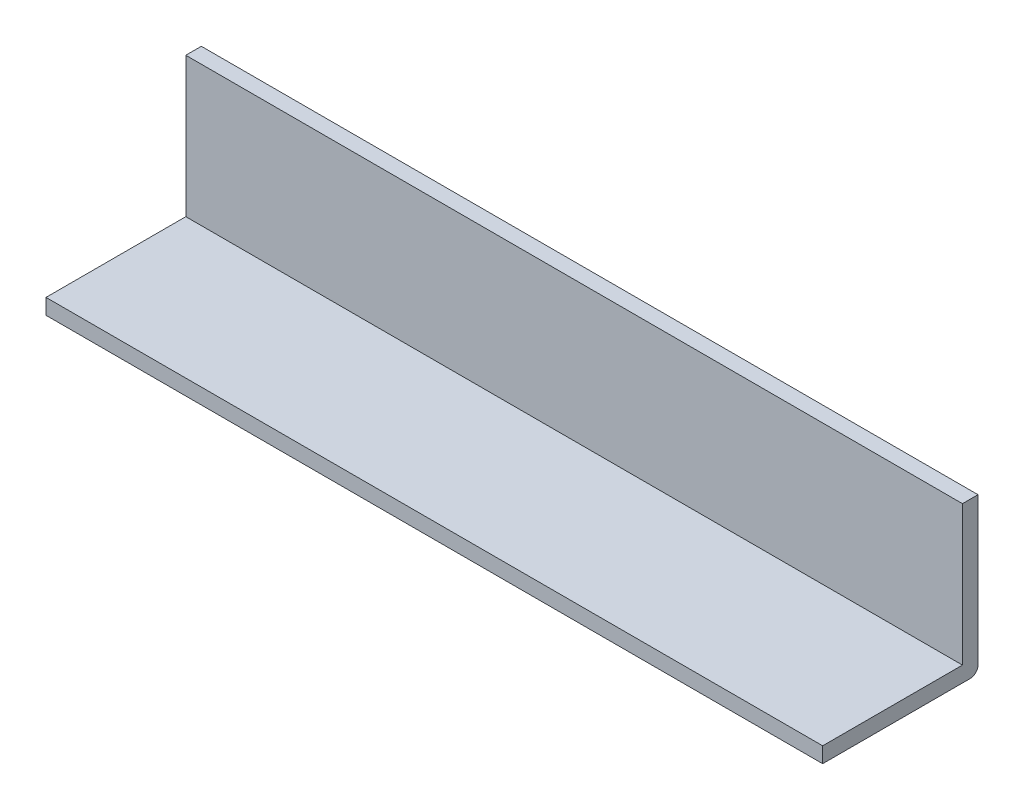
ISO-10303-21;
HEADER;
FILE_DESCRIPTION(('STEP AP214'),'2;1');
FILE_NAME('part.step','',(''),(''),'','','');
FILE_SCHEMA(('AUTOMOTIVE_DESIGN { 1 0 10303 214 1 1 1 1 }'));
ENDSEC;
DATA;
#1=APPLICATION_CONTEXT('core data for automotive mechanical design processes');
#2=APPLICATION_PROTOCOL_DEFINITION('international standard','automotive_design',2000,#1);
#3=PRODUCT_CONTEXT('',#1,'mechanical');
#4=PRODUCT('Part','Part','',(#3));
#5=PRODUCT_RELATED_PRODUCT_CATEGORY('part','',(#4));
#6=PRODUCT_DEFINITION_FORMATION('','',#4);
#7=PRODUCT_DEFINITION_CONTEXT('part definition',#1,'design');
#8=PRODUCT_DEFINITION('design','',#6,#7);
#9=PRODUCT_DEFINITION_SHAPE('','',#8);
#10=(LENGTH_UNIT() NAMED_UNIT(*) SI_UNIT(.MILLI.,.METRE.));
#11=(NAMED_UNIT(*) PLANE_ANGLE_UNIT() SI_UNIT($,.RADIAN.));
#12=(NAMED_UNIT(*) SI_UNIT($,.STERADIAN.) SOLID_ANGLE_UNIT());
#13=UNCERTAINTY_MEASURE_WITH_UNIT(LENGTH_MEASURE(1.E-05),#10,'distance_accuracy_value','');
#14=(GEOMETRIC_REPRESENTATION_CONTEXT(3) GLOBAL_UNCERTAINTY_ASSIGNED_CONTEXT((#13)) GLOBAL_UNIT_ASSIGNED_CONTEXT((#10,
#11,#12)) REPRESENTATION_CONTEXT('',''));
#15=CARTESIAN_POINT('',(0.,0.,0.));
#16=DIRECTION('',(0.,0.,1.));
#17=DIRECTION('',(1.,0.,0.));
#18=AXIS2_PLACEMENT_3D('',#15,#16,#17);
#19=CARTESIAN_POINT('',(50.,6.31112979018479,-0.871241454827603));
#20=DIRECTION('',(0.,1.,0.));
#21=DIRECTION('',(0.,0.,1.));
#22=AXIS2_PLACEMENT_3D('',#19,#20,#21);
#23=PLANE('',#22);
#24=DIRECTION('',(0.,0.,-1.));
#25=VECTOR('',#24,1.);
#26=CARTESIAN_POINT('',(0.,6.31112979018479,-0.871241454827603));
#27=LINE('',#26,#25);
#28=CARTESIAN_POINT('',(0.,6.31112979018478,19.6378948464823));
#29=VERTEX_POINT('',#28);
#30=CARTESIAN_POINT('',(0.,6.31112979018479,10.1378948464823));
#31=VERTEX_POINT('',#30);
#32=EDGE_CURVE('E121',#29,#31,#27,.T.);
#33=ORIENTED_EDGE('',*,*,#32,.T.);
#34=DIRECTION('',(-1.,0.,0.));
#35=VECTOR('',#34,1.);
#36=CARTESIAN_POINT('',(50.,6.31112979018479,10.1378948464823));
#37=LINE('',#36,#35);
#38=CARTESIAN_POINT('',(50.,6.31112979018479,10.1378948464823));
#39=VERTEX_POINT('',#38);
#40=EDGE_CURVE('E11',#39,#31,#37,.T.);
#41=ORIENTED_EDGE('',*,*,#40,.F.);
#42=DIRECTION('',(0.,0.,-1.));
#43=VECTOR('',#42,1.);
#44=CARTESIAN_POINT('',(50.,6.31112979018479,-0.871241454827603));
#45=LINE('',#44,#43);
#46=CARTESIAN_POINT('',(50.,6.31112979018478,19.6378948464823));
#47=VERTEX_POINT('',#46);
#48=EDGE_CURVE('E82',#47,#39,#45,.T.);
#49=ORIENTED_EDGE('',*,*,#48,.F.);
#50=DIRECTION('',(-1.,0.,0.));
#51=VECTOR('',#50,1.);
#52=CARTESIAN_POINT('',(50.,6.31112979018478,19.6378948464823));
#53=LINE('',#52,#51);
#54=EDGE_CURVE('E117',#47,#29,#53,.T.);
#55=ORIENTED_EDGE('',*,*,#54,.T.);
#56=EDGE_LOOP('',(#33,#41,#49,#55));
#57=FACE_BOUND('',#56,.T.);
#58=ADVANCED_FACE('F33',(#57),#23,.F.);
#59=CARTESIAN_POINT('',(50.,6.81112979018479,10.1378948464823));
#60=DIRECTION('',(-1.,0.,0.));
#61=DIRECTION('',(0.,0.,1.));
#62=AXIS2_PLACEMENT_3D('',#59,#60,#61);
#63=CYLINDRICAL_SURFACE('',#62,0.5);
#64=CARTESIAN_POINT('',(0.,6.81112979018479,10.1378948464823));
#65=DIRECTION('',(1.,0.,0.));
#66=DIRECTION('',(0.,0.,-1.));
#67=AXIS2_PLACEMENT_3D('',#64,#65,#66);
#68=CIRCLE('',#67,0.5);
#69=CARTESIAN_POINT('',(0.,6.81112979018479,9.63789484648225));
#70=VERTEX_POINT('',#69);
#71=EDGE_CURVE('E124',#70,#31,#68,.F.);
#72=ORIENTED_EDGE('',*,*,#71,.F.);
#73=DIRECTION('',(-1.,0.,0.));
#74=VECTOR('',#73,1.);
#75=CARTESIAN_POINT('',(50.,6.81112979018479,9.63789484648225));
#76=LINE('',#75,#74);
#77=CARTESIAN_POINT('',(50.,6.81112979018479,9.63789484648225));
#78=VERTEX_POINT('',#77);
#79=EDGE_CURVE('E41',#78,#70,#76,.T.);
#80=ORIENTED_EDGE('',*,*,#79,.F.);
#81=CARTESIAN_POINT('',(50.,6.81112979018479,10.1378948464823));
#82=DIRECTION('',(1.,0.,0.));
#83=DIRECTION('',(0.,0.,-1.));
#84=AXIS2_PLACEMENT_3D('',#81,#82,#83);
#85=CIRCLE('',#84,0.5);
#86=EDGE_CURVE('E156',#78,#39,#85,.F.);
#87=ORIENTED_EDGE('',*,*,#86,.T.);
#88=ORIENTED_EDGE('',*,*,#40,.T.);
#89=EDGE_LOOP('',(#72,#80,#87,#88));
#90=FACE_BOUND('',#89,.T.);
#91=ADVANCED_FACE('F149',(#90),#63,.T.);
#92=CARTESIAN_POINT('',(50.,9.09144815564303,9.63789484648225));
#93=DIRECTION('',(0.,0.,-1.));
#94=DIRECTION('',(-1.,0.,0.));
#95=AXIS2_PLACEMENT_3D('',#92,#93,#94);
#96=PLANE('',#95);
#97=DIRECTION('',(0.,-1.,0.));
#98=VECTOR('',#97,1.);
#99=CARTESIAN_POINT('',(0.,9.09144815564303,9.63789484648225));
#100=LINE('',#99,#98);
#101=CARTESIAN_POINT('',(0.,16.3111297901848,9.63789484648225));
#102=VERTEX_POINT('',#101);
#103=EDGE_CURVE('E127',#102,#70,#100,.T.);
#104=ORIENTED_EDGE('',*,*,#103,.F.);
#105=DIRECTION('',(-1.,0.,0.));
#106=VECTOR('',#105,1.);
#107=CARTESIAN_POINT('',(50.,16.3111297901848,9.63789484648225));
#108=LINE('',#107,#106);
#109=CARTESIAN_POINT('',(50.,16.3111297901848,9.63789484648225));
#110=VERTEX_POINT('',#109);
#111=EDGE_CURVE('E140',#110,#102,#108,.T.);
#112=ORIENTED_EDGE('',*,*,#111,.F.);
#113=DIRECTION('',(0.,-1.,0.));
#114=VECTOR('',#113,1.);
#115=CARTESIAN_POINT('',(50.,9.09144815564303,9.63789484648225));
#116=LINE('',#115,#114);
#117=EDGE_CURVE('E146',#110,#78,#116,.T.);
#118=ORIENTED_EDGE('',*,*,#117,.T.);
#119=ORIENTED_EDGE('',*,*,#79,.T.);
#120=EDGE_LOOP('',(#104,#112,#118,#119));
#121=FACE_BOUND('',#120,.T.);
#122=ADVANCED_FACE('F145',(#121),#96,.T.);
#123=CARTESIAN_POINT('',(50.,16.3111297901848,-0.871241454827603));
#124=DIRECTION('',(0.,-1.,0.));
#125=DIRECTION('',(0.,0.,-1.));
#126=AXIS2_PLACEMENT_3D('',#123,#124,#125);
#127=PLANE('',#126);
#128=DIRECTION('',(0.,0.,1.));
#129=VECTOR('',#128,1.);
#130=CARTESIAN_POINT('',(0.,16.3111297901848,-0.871241454827603));
#131=LINE('',#130,#129);
#132=CARTESIAN_POINT('',(0.,16.3111297901848,10.6378948464823));
#133=VERTEX_POINT('',#132);
#134=EDGE_CURVE('E130',#102,#133,#131,.T.);
#135=ORIENTED_EDGE('',*,*,#134,.T.);
#136=DIRECTION('',(-1.,0.,0.));
#137=VECTOR('',#136,1.);
#138=CARTESIAN_POINT('',(50.,16.3111297901848,10.6378948464823));
#139=LINE('',#138,#137);
#140=CARTESIAN_POINT('',(50.,16.3111297901848,10.6378948464823));
#141=VERTEX_POINT('',#140);
#142=EDGE_CURVE('E106',#141,#133,#139,.T.);
#143=ORIENTED_EDGE('',*,*,#142,.F.);
#144=DIRECTION('',(0.,0.,1.));
#145=VECTOR('',#144,1.);
#146=CARTESIAN_POINT('',(50.,16.3111297901848,-0.871241454827603));
#147=LINE('',#146,#145);
#148=EDGE_CURVE('E112',#110,#141,#147,.T.);
#149=ORIENTED_EDGE('',*,*,#148,.F.);
#150=ORIENTED_EDGE('',*,*,#111,.T.);
#151=EDGE_LOOP('',(#135,#143,#149,#150));
#152=FACE_BOUND('',#151,.T.);
#153=ADVANCED_FACE('F155',(#152),#127,.F.);
#154=CARTESIAN_POINT('',(50.,9.09144815564303,10.6378948464823));
#155=DIRECTION('',(0.,0.,1.));
#156=DIRECTION('',(1.,0.,0.));
#157=AXIS2_PLACEMENT_3D('',#154,#155,#156);
#158=PLANE('',#157);
#159=DIRECTION('',(0.,1.,0.));
#160=VECTOR('',#159,1.);
#161=CARTESIAN_POINT('',(0.,9.09144815564303,10.6378948464823));
#162=LINE('',#161,#160);
#163=CARTESIAN_POINT('',(0.,7.31112979018478,10.6378948464823));
#164=VERTEX_POINT('',#163);
#165=EDGE_CURVE('E101',#164,#133,#162,.T.);
#166=ORIENTED_EDGE('',*,*,#165,.F.);
#167=DIRECTION('',(-1.,0.,0.));
#168=VECTOR('',#167,1.);
#169=CARTESIAN_POINT('',(50.,7.31112979018478,10.6378948464823));
#170=LINE('',#169,#168);
#171=CARTESIAN_POINT('',(50.,7.31112979018478,10.6378948464823));
#172=VERTEX_POINT('',#171);
#173=EDGE_CURVE('E96',#172,#164,#170,.T.);
#174=ORIENTED_EDGE('',*,*,#173,.F.);
#175=DIRECTION('',(0.,1.,0.));
#176=VECTOR('',#175,1.);
#177=CARTESIAN_POINT('',(50.,9.09144815564303,10.6378948464823));
#178=LINE('',#177,#176);
#179=EDGE_CURVE('E99',#172,#141,#178,.T.);
#180=ORIENTED_EDGE('',*,*,#179,.T.);
#181=ORIENTED_EDGE('',*,*,#142,.T.);
#182=EDGE_LOOP('',(#166,#174,#180,#181));
#183=FACE_BOUND('',#182,.T.);
#184=ADVANCED_FACE('F98',(#183),#158,.T.);
#185=CARTESIAN_POINT('',(50.,7.31112979018478,-0.871241454827603));
#186=DIRECTION('',(0.,1.,0.));
#187=DIRECTION('',(0.,0.,1.));
#188=AXIS2_PLACEMENT_3D('',#185,#186,#187);
#189=PLANE('',#188);
#190=DIRECTION('',(0.,0.,-1.));
#191=VECTOR('',#190,1.);
#192=CARTESIAN_POINT('',(0.,7.31112979018478,-0.871241454827603));
#193=LINE('',#192,#191);
#194=CARTESIAN_POINT('',(0.,7.31112979018479,19.6378948464823));
#195=VERTEX_POINT('',#194);
#196=EDGE_CURVE('E134',#195,#164,#193,.T.);
#197=ORIENTED_EDGE('',*,*,#196,.F.);
#198=DIRECTION('',(-1.,0.,0.));
#199=VECTOR('',#198,1.);
#200=CARTESIAN_POINT('',(50.,7.31112979018479,19.6378948464823));
#201=LINE('',#200,#199);
#202=CARTESIAN_POINT('',(50.,7.31112979018479,19.6378948464823));
#203=VERTEX_POINT('',#202);
#204=EDGE_CURVE('E73',#203,#195,#201,.T.);
#205=ORIENTED_EDGE('',*,*,#204,.F.);
#206=DIRECTION('',(0.,0.,-1.));
#207=VECTOR('',#206,1.);
#208=CARTESIAN_POINT('',(50.,7.31112979018478,-0.871241454827603));
#209=LINE('',#208,#207);
#210=EDGE_CURVE('E109',#203,#172,#209,.T.);
#211=ORIENTED_EDGE('',*,*,#210,.T.);
#212=ORIENTED_EDGE('',*,*,#173,.T.);
#213=EDGE_LOOP('',(#197,#205,#211,#212));
#214=FACE_BOUND('',#213,.T.);
#215=ADVANCED_FACE('F115',(#214),#189,.T.);
#216=CARTESIAN_POINT('',(50.,9.09144815564303,19.6378948464823));
#217=DIRECTION('',(0.,0.,-1.));
#218=DIRECTION('',(-1.,0.,0.));
#219=AXIS2_PLACEMENT_3D('',#216,#217,#218);
#220=PLANE('',#219);
#221=DIRECTION('',(0.,-1.,0.));
#222=VECTOR('',#221,1.);
#223=CARTESIAN_POINT('',(0.,9.09144815564303,19.6378948464823));
#224=LINE('',#223,#222);
#225=EDGE_CURVE('E76',#195,#29,#224,.T.);
#226=ORIENTED_EDGE('',*,*,#225,.T.);
#227=ORIENTED_EDGE('',*,*,#54,.F.);
#228=DIRECTION('',(0.,-1.,0.));
#229=VECTOR('',#228,1.);
#230=CARTESIAN_POINT('',(50.,9.09144815564303,19.6378948464823));
#231=LINE('',#230,#229);
#232=EDGE_CURVE('E49',#203,#47,#231,.T.);
#233=ORIENTED_EDGE('',*,*,#232,.F.);
#234=ORIENTED_EDGE('',*,*,#204,.T.);
#235=EDGE_LOOP('',(#226,#227,#233,#234));
#236=FACE_BOUND('',#235,.T.);
#237=ADVANCED_FACE('F173',(#236),#220,.F.);
#238=CARTESIAN_POINT('',(50.,9.09144815564303,-0.871241454827603));
#239=DIRECTION('',(1.,0.,0.));
#240=DIRECTION('',(0.,0.,-1.));
#241=AXIS2_PLACEMENT_3D('',#238,#239,#240);
#242=PLANE('',#241);
#243=ORIENTED_EDGE('',*,*,#48,.T.);
#244=ORIENTED_EDGE('',*,*,#86,.F.);
#245=ORIENTED_EDGE('',*,*,#117,.F.);
#246=ORIENTED_EDGE('',*,*,#148,.T.);
#247=ORIENTED_EDGE('',*,*,#179,.F.);
#248=ORIENTED_EDGE('',*,*,#210,.F.);
#249=ORIENTED_EDGE('',*,*,#232,.T.);
#250=EDGE_LOOP('',(#243,#244,#245,#246,#247,#248,#249));
#251=FACE_BOUND('',#250,.T.);
#252=ADVANCED_FACE('F108',(#251),#242,.T.);
#253=CARTESIAN_POINT('',(0.,9.09144815564303,-0.871241454827603));
#254=DIRECTION('',(1.,0.,0.));
#255=DIRECTION('',(0.,0.,-1.));
#256=AXIS2_PLACEMENT_3D('',#253,#254,#255);
#257=PLANE('',#256);
#258=ORIENTED_EDGE('',*,*,#32,.F.);
#259=ORIENTED_EDGE('',*,*,#225,.F.);
#260=ORIENTED_EDGE('',*,*,#196,.T.);
#261=ORIENTED_EDGE('',*,*,#165,.T.);
#262=ORIENTED_EDGE('',*,*,#134,.F.);
#263=ORIENTED_EDGE('',*,*,#103,.T.);
#264=ORIENTED_EDGE('',*,*,#71,.T.);
#265=EDGE_LOOP('',(#258,#259,#260,#261,#262,#263,#264));
#266=FACE_BOUND('',#265,.T.);
#267=ADVANCED_FACE('F153',(#266),#257,.F.);
#268=CLOSED_SHELL('',(#58,#91,#122,#153,#184,#215,#237,#252,#267));
#269=MANIFOLD_SOLID_BREP('B2',#268);
#270=ADVANCED_BREP_SHAPE_REPRESENTATION('',(#18,#269),#14);
#271=SHAPE_DEFINITION_REPRESENTATION(#9,#270);
ENDSEC;
END-ISO-10303-21;
